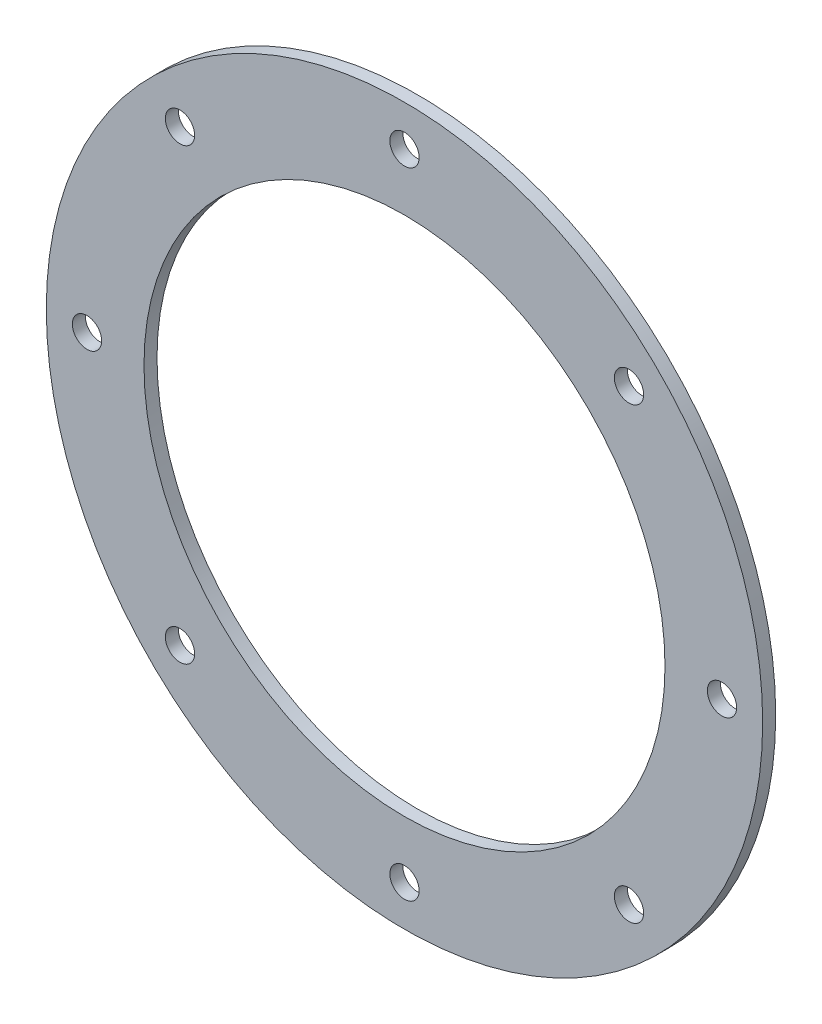
ISO-10303-21;
HEADER;
FILE_DESCRIPTION(('STEP AP214'),'2;1');
FILE_NAME('part.step','',(''),(''),'','','');
FILE_SCHEMA(('AUTOMOTIVE_DESIGN { 1 0 10303 214 1 1 1 1 }'));
ENDSEC;
DATA;
#1=APPLICATION_CONTEXT('core data for automotive mechanical design processes');
#2=APPLICATION_PROTOCOL_DEFINITION('international standard','automotive_design',2000,#1);
#3=PRODUCT_CONTEXT('',#1,'mechanical');
#4=PRODUCT('Part','Part','',(#3));
#5=PRODUCT_RELATED_PRODUCT_CATEGORY('part','',(#4));
#6=PRODUCT_DEFINITION_FORMATION('','',#4);
#7=PRODUCT_DEFINITION_CONTEXT('part definition',#1,'design');
#8=PRODUCT_DEFINITION('design','',#6,#7);
#9=PRODUCT_DEFINITION_SHAPE('','',#8);
#10=(LENGTH_UNIT() NAMED_UNIT(*) SI_UNIT(.MILLI.,.METRE.));
#11=(NAMED_UNIT(*) PLANE_ANGLE_UNIT() SI_UNIT($,.RADIAN.));
#12=(NAMED_UNIT(*) SI_UNIT($,.STERADIAN.) SOLID_ANGLE_UNIT());
#13=UNCERTAINTY_MEASURE_WITH_UNIT(LENGTH_MEASURE(1.E-05),#10,'distance_accuracy_value','');
#14=(GEOMETRIC_REPRESENTATION_CONTEXT(3) GLOBAL_UNCERTAINTY_ASSIGNED_CONTEXT((#13)) GLOBAL_UNIT_ASSIGNED_CONTEXT((#10,
#11,#12)) REPRESENTATION_CONTEXT('',''));
#15=CARTESIAN_POINT('',(0.,0.,0.));
#16=DIRECTION('',(0.,0.,1.));
#17=DIRECTION('',(1.,0.,0.));
#18=AXIS2_PLACEMENT_3D('',#15,#16,#17);
#19=CARTESIAN_POINT('',(0.,0.,-1404.));
#20=DIRECTION('',(0.,0.,-1.));
#21=DIRECTION('',(-1.,0.,0.));
#22=AXIS2_PLACEMENT_3D('',#19,#20,#21);
#23=PLANE('',#22);
#24=CARTESIAN_POINT('',(-97.5,1.02125829161162E-12,-1404.));
#25=DIRECTION('',(0.,0.,1.));
#26=DIRECTION('',(1.,0.,0.));
#27=AXIS2_PLACEMENT_3D('',#24,#25,#26);
#28=CIRCLE('',#27,4.5);
#29=CARTESIAN_POINT('',(-93.,1.02125829161162E-12,-1404.));
#30=VERTEX_POINT('',#29);
#31=EDGE_CURVE('E94',#30,#30,#28,.T.);
#32=ORIENTED_EDGE('',*,*,#31,.F.);
#33=EDGE_LOOP('',(#32));
#34=FACE_BOUND('',#33,.T.);
#35=CARTESIAN_POINT('',(-68.942911165689,-68.9429111656878,-1404.));
#36=DIRECTION('',(0.,0.,1.));
#37=DIRECTION('',(1.,0.,0.));
#38=AXIS2_PLACEMENT_3D('',#35,#36,#37);
#39=CIRCLE('',#38,4.5);
#40=CARTESIAN_POINT('',(-64.442911165689,-68.9429111656878,-1404.));
#41=VERTEX_POINT('',#40);
#42=EDGE_CURVE('E88',#41,#41,#39,.T.);
#43=ORIENTED_EDGE('',*,*,#42,.F.);
#44=EDGE_LOOP('',(#43));
#45=FACE_BOUND('',#44,.T.);
#46=CARTESIAN_POINT('',(68.942911165688,-68.9429111656888,-1404.));
#47=DIRECTION('',(0.,0.,1.));
#48=DIRECTION('',(1.,0.,0.));
#49=AXIS2_PLACEMENT_3D('',#46,#47,#48);
#50=CIRCLE('',#49,4.5);
#51=CARTESIAN_POINT('',(73.442911165688,-68.9429111656888,-1404.));
#52=VERTEX_POINT('',#51);
#53=EDGE_CURVE('E76',#52,#52,#50,.T.);
#54=ORIENTED_EDGE('',*,*,#53,.F.);
#55=EDGE_LOOP('',(#54));
#56=FACE_BOUND('',#55,.T.);
#57=CARTESIAN_POINT('',(97.5,-3.40419430537206E-13,-1404.));
#58=DIRECTION('',(0.,0.,1.));
#59=DIRECTION('',(1.,0.,0.));
#60=AXIS2_PLACEMENT_3D('',#57,#58,#59);
#61=CIRCLE('',#60,4.5);
#62=CARTESIAN_POINT('',(102.,-3.40419430537206E-13,-1404.));
#63=VERTEX_POINT('',#62);
#64=EDGE_CURVE('E70',#63,#63,#61,.T.);
#65=ORIENTED_EDGE('',*,*,#64,.F.);
#66=EDGE_LOOP('',(#65));
#67=FACE_BOUND('',#66,.T.);
#68=CARTESIAN_POINT('',(68.9429111656885,68.9429111656883,-1404.));
#69=DIRECTION('',(0.,0.,1.));
#70=DIRECTION('',(1.,0.,0.));
#71=AXIS2_PLACEMENT_3D('',#68,#69,#70);
#72=CIRCLE('',#71,4.5);
#73=CARTESIAN_POINT('',(73.4429111656885,68.9429111656883,-1404.));
#74=VERTEX_POINT('',#73);
#75=EDGE_CURVE('E64',#74,#74,#72,.T.);
#76=ORIENTED_EDGE('',*,*,#75,.F.);
#77=EDGE_LOOP('',(#76));
#78=FACE_BOUND('',#77,.T.);
#79=CARTESIAN_POINT('',(0.,97.5,-1404.));
#80=DIRECTION('',(0.,0.,1.));
#81=DIRECTION('',(1.,0.,0.));
#82=AXIS2_PLACEMENT_3D('',#79,#80,#81);
#83=CIRCLE('',#82,4.5);
#84=CARTESIAN_POINT('',(4.5,97.5,-1404.));
#85=VERTEX_POINT('',#84);
#86=EDGE_CURVE('E58',#85,#85,#83,.T.);
#87=ORIENTED_EDGE('',*,*,#86,.F.);
#88=EDGE_LOOP('',(#87));
#89=FACE_BOUND('',#88,.T.);
#90=CARTESIAN_POINT('',(0.,0.,-1404.));
#91=DIRECTION('',(0.,0.,-1.));
#92=DIRECTION('',(-1.,0.,0.));
#93=AXIS2_PLACEMENT_3D('',#90,#91,#92);
#94=CIRCLE('',#93,110.);
#95=CARTESIAN_POINT('',(-110.,0.,-1404.));
#96=VERTEX_POINT('',#95);
#97=EDGE_CURVE('E41',#96,#96,#94,.T.);
#98=ORIENTED_EDGE('',*,*,#97,.F.);
#99=EDGE_LOOP('',(#98));
#100=FACE_BOUND('',#99,.T.);
#101=CARTESIAN_POINT('',(0.,0.,-1404.));
#102=DIRECTION('',(0.,0.,-1.));
#103=DIRECTION('',(-1.,0.,0.));
#104=AXIS2_PLACEMENT_3D('',#101,#102,#103);
#105=CIRCLE('',#104,80.);
#106=CARTESIAN_POINT('',(-80.,0.,-1404.));
#107=VERTEX_POINT('',#106);
#108=EDGE_CURVE('E50',#107,#107,#105,.T.);
#109=ORIENTED_EDGE('',*,*,#108,.T.);
#110=EDGE_LOOP('',(#109));
#111=FACE_BOUND('',#110,.T.);
#112=CARTESIAN_POINT('',(0.,-97.5,-1404.));
#113=DIRECTION('',(0.,0.,1.));
#114=DIRECTION('',(1.,0.,0.));
#115=AXIS2_PLACEMENT_3D('',#112,#113,#114);
#116=CIRCLE('',#115,4.5);
#117=CARTESIAN_POINT('',(4.5,-97.5,-1404.));
#118=VERTEX_POINT('',#117);
#119=EDGE_CURVE('E82',#118,#118,#116,.T.);
#120=ORIENTED_EDGE('',*,*,#119,.F.);
#121=EDGE_LOOP('',(#120));
#122=FACE_BOUND('',#121,.T.);
#123=CARTESIAN_POINT('',(-68.9429111656875,68.9429111656892,-1404.));
#124=DIRECTION('',(0.,0.,1.));
#125=DIRECTION('',(1.,0.,0.));
#126=AXIS2_PLACEMENT_3D('',#123,#124,#125);
#127=CIRCLE('',#126,4.5);
#128=CARTESIAN_POINT('',(-64.4429111656875,68.9429111656892,-1404.));
#129=VERTEX_POINT('',#128);
#130=EDGE_CURVE('E100',#129,#129,#127,.T.);
#131=ORIENTED_EDGE('',*,*,#130,.F.);
#132=EDGE_LOOP('',(#131));
#133=FACE_BOUND('',#132,.T.);
#134=ADVANCED_FACE('F37',(#34,#45,#56,#67,#78,#89,#100,#111,#122,#133),#23,.F.);
#135=CARTESIAN_POINT('',(0.,0.,-1408.));
#136=DIRECTION('',(0.,0.,-1.));
#137=DIRECTION('',(-1.,0.,0.));
#138=AXIS2_PLACEMENT_3D('',#135,#136,#137);
#139=PLANE('',#138);
#140=CARTESIAN_POINT('',(-68.9429111656875,68.9429111656892,-1408.));
#141=DIRECTION('',(0.,0.,1.));
#142=DIRECTION('',(1.,0.,0.));
#143=AXIS2_PLACEMENT_3D('',#140,#141,#142);
#144=CIRCLE('',#143,4.5);
#145=CARTESIAN_POINT('',(-64.4429111656875,68.9429111656892,-1408.));
#146=VERTEX_POINT('',#145);
#147=EDGE_CURVE('E97',#146,#146,#144,.T.);
#148=ORIENTED_EDGE('',*,*,#147,.T.);
#149=EDGE_LOOP('',(#148));
#150=FACE_BOUND('',#149,.T.);
#151=CARTESIAN_POINT('',(0.,0.,-1408.));
#152=DIRECTION('',(0.,0.,-1.));
#153=DIRECTION('',(-1.,0.,0.));
#154=AXIS2_PLACEMENT_3D('',#151,#152,#153);
#155=CIRCLE('',#154,80.);
#156=CARTESIAN_POINT('',(-80.,0.,-1408.));
#157=VERTEX_POINT('',#156);
#158=EDGE_CURVE('E48',#157,#157,#155,.T.);
#159=ORIENTED_EDGE('',*,*,#158,.F.);
#160=EDGE_LOOP('',(#159));
#161=FACE_BOUND('',#160,.T.);
#162=CARTESIAN_POINT('',(0.,0.,-1408.));
#163=DIRECTION('',(0.,0.,-1.));
#164=DIRECTION('',(-1.,0.,0.));
#165=AXIS2_PLACEMENT_3D('',#162,#163,#164);
#166=CIRCLE('',#165,110.);
#167=CARTESIAN_POINT('',(-110.,0.,-1408.));
#168=VERTEX_POINT('',#167);
#169=EDGE_CURVE('E10',#168,#168,#166,.T.);
#170=ORIENTED_EDGE('',*,*,#169,.T.);
#171=EDGE_LOOP('',(#170));
#172=FACE_BOUND('',#171,.T.);
#173=CARTESIAN_POINT('',(0.,97.5,-1408.));
#174=DIRECTION('',(0.,0.,1.));
#175=DIRECTION('',(1.,0.,0.));
#176=AXIS2_PLACEMENT_3D('',#173,#174,#175);
#177=CIRCLE('',#176,4.5);
#178=CARTESIAN_POINT('',(4.5,97.5,-1408.));
#179=VERTEX_POINT('',#178);
#180=EDGE_CURVE('E53',#179,#179,#177,.T.);
#181=ORIENTED_EDGE('',*,*,#180,.T.);
#182=EDGE_LOOP('',(#181));
#183=FACE_BOUND('',#182,.T.);
#184=CARTESIAN_POINT('',(68.9429111656885,68.9429111656883,-1408.));
#185=DIRECTION('',(0.,0.,1.));
#186=DIRECTION('',(1.,0.,0.));
#187=AXIS2_PLACEMENT_3D('',#184,#185,#186);
#188=CIRCLE('',#187,4.5);
#189=CARTESIAN_POINT('',(73.4429111656885,68.9429111656883,-1408.));
#190=VERTEX_POINT('',#189);
#191=EDGE_CURVE('E61',#190,#190,#188,.T.);
#192=ORIENTED_EDGE('',*,*,#191,.T.);
#193=EDGE_LOOP('',(#192));
#194=FACE_BOUND('',#193,.T.);
#195=CARTESIAN_POINT('',(97.5,-3.40419430537206E-13,-1408.));
#196=DIRECTION('',(0.,0.,1.));
#197=DIRECTION('',(1.,0.,0.));
#198=AXIS2_PLACEMENT_3D('',#195,#196,#197);
#199=CIRCLE('',#198,4.5);
#200=CARTESIAN_POINT('',(102.,-3.40419430537206E-13,-1408.));
#201=VERTEX_POINT('',#200);
#202=EDGE_CURVE('E67',#201,#201,#199,.T.);
#203=ORIENTED_EDGE('',*,*,#202,.T.);
#204=EDGE_LOOP('',(#203));
#205=FACE_BOUND('',#204,.T.);
#206=CARTESIAN_POINT('',(68.942911165688,-68.9429111656888,-1408.));
#207=DIRECTION('',(0.,0.,1.));
#208=DIRECTION('',(1.,0.,0.));
#209=AXIS2_PLACEMENT_3D('',#206,#207,#208);
#210=CIRCLE('',#209,4.5);
#211=CARTESIAN_POINT('',(73.442911165688,-68.9429111656888,-1408.));
#212=VERTEX_POINT('',#211);
#213=EDGE_CURVE('E73',#212,#212,#210,.T.);
#214=ORIENTED_EDGE('',*,*,#213,.T.);
#215=EDGE_LOOP('',(#214));
#216=FACE_BOUND('',#215,.T.);
#217=CARTESIAN_POINT('',(0.,-97.5,-1408.));
#218=DIRECTION('',(0.,0.,1.));
#219=DIRECTION('',(1.,0.,0.));
#220=AXIS2_PLACEMENT_3D('',#217,#218,#219);
#221=CIRCLE('',#220,4.5);
#222=CARTESIAN_POINT('',(4.5,-97.5,-1408.));
#223=VERTEX_POINT('',#222);
#224=EDGE_CURVE('E79',#223,#223,#221,.T.);
#225=ORIENTED_EDGE('',*,*,#224,.T.);
#226=EDGE_LOOP('',(#225));
#227=FACE_BOUND('',#226,.T.);
#228=CARTESIAN_POINT('',(-68.942911165689,-68.9429111656878,-1408.));
#229=DIRECTION('',(0.,0.,1.));
#230=DIRECTION('',(1.,0.,0.));
#231=AXIS2_PLACEMENT_3D('',#228,#229,#230);
#232=CIRCLE('',#231,4.5);
#233=CARTESIAN_POINT('',(-64.442911165689,-68.9429111656878,-1408.));
#234=VERTEX_POINT('',#233);
#235=EDGE_CURVE('E85',#234,#234,#232,.T.);
#236=ORIENTED_EDGE('',*,*,#235,.T.);
#237=EDGE_LOOP('',(#236));
#238=FACE_BOUND('',#237,.T.);
#239=CARTESIAN_POINT('',(-97.5,1.02125829161162E-12,-1408.));
#240=DIRECTION('',(0.,0.,1.));
#241=DIRECTION('',(1.,0.,0.));
#242=AXIS2_PLACEMENT_3D('',#239,#240,#241);
#243=CIRCLE('',#242,4.5);
#244=CARTESIAN_POINT('',(-93.,1.02125829161162E-12,-1408.));
#245=VERTEX_POINT('',#244);
#246=EDGE_CURVE('E91',#245,#245,#243,.T.);
#247=ORIENTED_EDGE('',*,*,#246,.T.);
#248=EDGE_LOOP('',(#247));
#249=FACE_BOUND('',#248,.T.);
#250=ADVANCED_FACE('F107',(#150,#161,#172,#183,#194,#205,#216,#227,#238,#249),#139,.T.);
#251=CARTESIAN_POINT('',(0.,0.,-1408.));
#252=DIRECTION('',(0.,0.,1.));
#253=DIRECTION('',(1.,0.,0.));
#254=AXIS2_PLACEMENT_3D('',#251,#252,#253);
#255=CYLINDRICAL_SURFACE('',#254,110.);
#256=ORIENTED_EDGE('',*,*,#169,.F.);
#257=EDGE_LOOP('',(#256));
#258=FACE_BOUND('',#257,.T.);
#259=ORIENTED_EDGE('',*,*,#97,.T.);
#260=EDGE_LOOP('',(#259));
#261=FACE_BOUND('',#260,.T.);
#262=ADVANCED_FACE('F39',(#258,#261),#255,.T.);
#263=CARTESIAN_POINT('',(0.,0.,-1408.));
#264=DIRECTION('',(0.,0.,1.));
#265=DIRECTION('',(1.,0.,0.));
#266=AXIS2_PLACEMENT_3D('',#263,#264,#265);
#267=CYLINDRICAL_SURFACE('',#266,80.);
#268=ORIENTED_EDGE('',*,*,#158,.T.);
#269=EDGE_LOOP('',(#268));
#270=FACE_BOUND('',#269,.T.);
#271=ORIENTED_EDGE('',*,*,#108,.F.);
#272=EDGE_LOOP('',(#271));
#273=FACE_BOUND('',#272,.T.);
#274=ADVANCED_FACE('F117',(#270,#273),#267,.F.);
#275=CARTESIAN_POINT('',(0.,97.5,-1404.));
#276=DIRECTION('',(0.,0.,1.));
#277=DIRECTION('',(1.,0.,0.));
#278=AXIS2_PLACEMENT_3D('',#275,#276,#277);
#279=CYLINDRICAL_SURFACE('',#278,4.5);
#280=ORIENTED_EDGE('',*,*,#180,.F.);
#281=EDGE_LOOP('',(#280));
#282=FACE_BOUND('',#281,.T.);
#283=ORIENTED_EDGE('',*,*,#86,.T.);
#284=EDGE_LOOP('',(#283));
#285=FACE_BOUND('',#284,.T.);
#286=ADVANCED_FACE('F120',(#282,#285),#279,.F.);
#287=CARTESIAN_POINT('',(68.9429111656885,68.9429111656883,-1404.));
#288=DIRECTION('',(0.,0.,1.));
#289=DIRECTION('',(1.,0.,0.));
#290=AXIS2_PLACEMENT_3D('',#287,#288,#289);
#291=CYLINDRICAL_SURFACE('',#290,4.5);
#292=ORIENTED_EDGE('',*,*,#191,.F.);
#293=EDGE_LOOP('',(#292));
#294=FACE_BOUND('',#293,.T.);
#295=ORIENTED_EDGE('',*,*,#75,.T.);
#296=EDGE_LOOP('',(#295));
#297=FACE_BOUND('',#296,.T.);
#298=ADVANCED_FACE('F124',(#294,#297),#291,.F.);
#299=CARTESIAN_POINT('',(97.5,-3.40419430537206E-13,-1404.));
#300=DIRECTION('',(0.,0.,1.));
#301=DIRECTION('',(1.,0.,0.));
#302=AXIS2_PLACEMENT_3D('',#299,#300,#301);
#303=CYLINDRICAL_SURFACE('',#302,4.5);
#304=ORIENTED_EDGE('',*,*,#202,.F.);
#305=EDGE_LOOP('',(#304));
#306=FACE_BOUND('',#305,.T.);
#307=ORIENTED_EDGE('',*,*,#64,.T.);
#308=EDGE_LOOP('',(#307));
#309=FACE_BOUND('',#308,.T.);
#310=ADVANCED_FACE('F128',(#306,#309),#303,.F.);
#311=CARTESIAN_POINT('',(68.942911165688,-68.9429111656888,-1404.));
#312=DIRECTION('',(0.,0.,1.));
#313=DIRECTION('',(1.,0.,0.));
#314=AXIS2_PLACEMENT_3D('',#311,#312,#313);
#315=CYLINDRICAL_SURFACE('',#314,4.5);
#316=ORIENTED_EDGE('',*,*,#213,.F.);
#317=EDGE_LOOP('',(#316));
#318=FACE_BOUND('',#317,.T.);
#319=ORIENTED_EDGE('',*,*,#53,.T.);
#320=EDGE_LOOP('',(#319));
#321=FACE_BOUND('',#320,.T.);
#322=ADVANCED_FACE('F132',(#318,#321),#315,.F.);
#323=CARTESIAN_POINT('',(0.,-97.5,-1404.));
#324=DIRECTION('',(0.,0.,1.));
#325=DIRECTION('',(1.,0.,0.));
#326=AXIS2_PLACEMENT_3D('',#323,#324,#325);
#327=CYLINDRICAL_SURFACE('',#326,4.5);
#328=ORIENTED_EDGE('',*,*,#224,.F.);
#329=EDGE_LOOP('',(#328));
#330=FACE_BOUND('',#329,.T.);
#331=ORIENTED_EDGE('',*,*,#119,.T.);
#332=EDGE_LOOP('',(#331));
#333=FACE_BOUND('',#332,.T.);
#334=ADVANCED_FACE('F136',(#330,#333),#327,.F.);
#335=CARTESIAN_POINT('',(-68.942911165689,-68.9429111656878,-1404.));
#336=DIRECTION('',(0.,0.,1.));
#337=DIRECTION('',(1.,0.,0.));
#338=AXIS2_PLACEMENT_3D('',#335,#336,#337);
#339=CYLINDRICAL_SURFACE('',#338,4.5);
#340=ORIENTED_EDGE('',*,*,#235,.F.);
#341=EDGE_LOOP('',(#340));
#342=FACE_BOUND('',#341,.T.);
#343=ORIENTED_EDGE('',*,*,#42,.T.);
#344=EDGE_LOOP('',(#343));
#345=FACE_BOUND('',#344,.T.);
#346=ADVANCED_FACE('F140',(#342,#345),#339,.F.);
#347=CARTESIAN_POINT('',(-97.5,1.02125829161162E-12,-1404.));
#348=DIRECTION('',(0.,0.,1.));
#349=DIRECTION('',(1.,0.,0.));
#350=AXIS2_PLACEMENT_3D('',#347,#348,#349);
#351=CYLINDRICAL_SURFACE('',#350,4.5);
#352=ORIENTED_EDGE('',*,*,#246,.F.);
#353=EDGE_LOOP('',(#352));
#354=FACE_BOUND('',#353,.T.);
#355=ORIENTED_EDGE('',*,*,#31,.T.);
#356=EDGE_LOOP('',(#355));
#357=FACE_BOUND('',#356,.T.);
#358=ADVANCED_FACE('F144',(#354,#357),#351,.F.);
#359=CARTESIAN_POINT('',(-68.9429111656875,68.9429111656892,-1404.));
#360=DIRECTION('',(0.,0.,1.));
#361=DIRECTION('',(1.,0.,0.));
#362=AXIS2_PLACEMENT_3D('',#359,#360,#361);
#363=CYLINDRICAL_SURFACE('',#362,4.5);
#364=ORIENTED_EDGE('',*,*,#147,.F.);
#365=EDGE_LOOP('',(#364));
#366=FACE_BOUND('',#365,.T.);
#367=ORIENTED_EDGE('',*,*,#130,.T.);
#368=EDGE_LOOP('',(#367));
#369=FACE_BOUND('',#368,.T.);
#370=ADVANCED_FACE('F104',(#366,#369),#363,.F.);
#371=CLOSED_SHELL('',(#134,#250,#262,#274,#286,#298,#310,#322,#334,#346,#358,#370));
#372=MANIFOLD_SOLID_BREP('B2',#371);
#373=ADVANCED_BREP_SHAPE_REPRESENTATION('',(#18,#372),#14);
#374=SHAPE_DEFINITION_REPRESENTATION(#9,#373);
ENDSEC;
END-ISO-10303-21;
